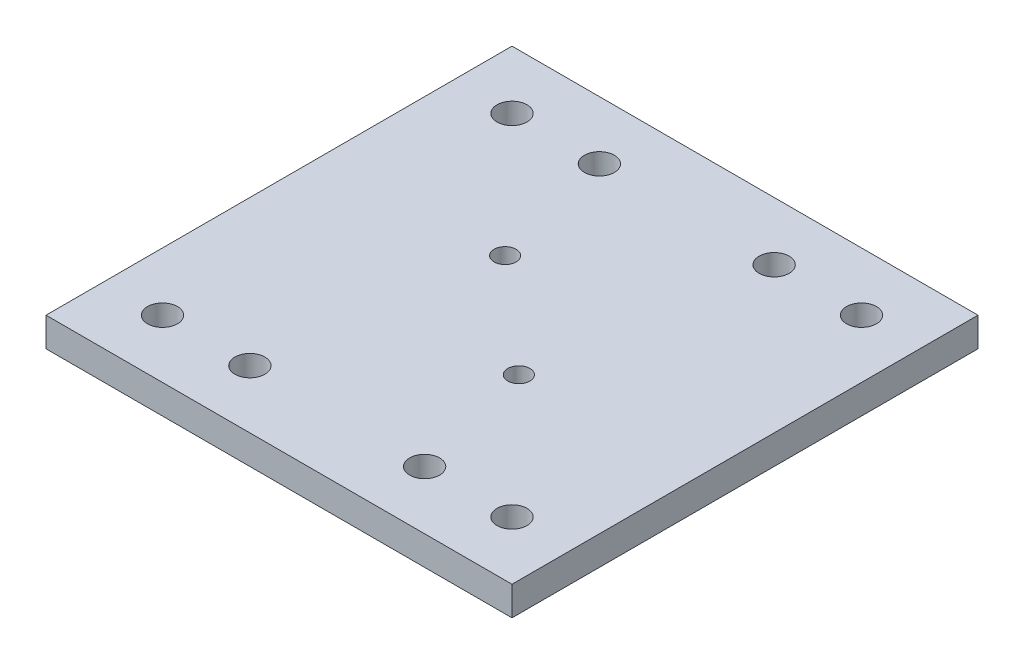
ISO-10303-21;
HEADER;
FILE_DESCRIPTION(('STEP AP214'),'2;1');
FILE_NAME('part.step','',(''),(''),'','','');
FILE_SCHEMA(('AUTOMOTIVE_DESIGN { 1 0 10303 214 1 1 1 1 }'));
ENDSEC;
DATA;
#1=APPLICATION_CONTEXT('core data for automotive mechanical design processes');
#2=APPLICATION_PROTOCOL_DEFINITION('international standard','automotive_design',2000,#1);
#3=PRODUCT_CONTEXT('',#1,'mechanical');
#4=PRODUCT('Part','Part','',(#3));
#5=PRODUCT_RELATED_PRODUCT_CATEGORY('part','',(#4));
#6=PRODUCT_DEFINITION_FORMATION('','',#4);
#7=PRODUCT_DEFINITION_CONTEXT('part definition',#1,'design');
#8=PRODUCT_DEFINITION('design','',#6,#7);
#9=PRODUCT_DEFINITION_SHAPE('','',#8);
#10=(LENGTH_UNIT() NAMED_UNIT(*) SI_UNIT(.MILLI.,.METRE.));
#11=(NAMED_UNIT(*) PLANE_ANGLE_UNIT() SI_UNIT($,.RADIAN.));
#12=(NAMED_UNIT(*) SI_UNIT($,.STERADIAN.) SOLID_ANGLE_UNIT());
#13=UNCERTAINTY_MEASURE_WITH_UNIT(LENGTH_MEASURE(1.E-05),#10,'distance_accuracy_value','');
#14=(GEOMETRIC_REPRESENTATION_CONTEXT(3) GLOBAL_UNCERTAINTY_ASSIGNED_CONTEXT((#13)) GLOBAL_UNIT_ASSIGNED_CONTEXT((#10,
#11,#12)) REPRESENTATION_CONTEXT('',''));
#15=CARTESIAN_POINT('',(0.,0.,0.));
#16=DIRECTION('',(0.,0.,1.));
#17=DIRECTION('',(1.,0.,0.));
#18=AXIS2_PLACEMENT_3D('',#15,#16,#17);
#19=CARTESIAN_POINT('',(25.4,3.175,-25.4));
#20=DIRECTION('',(-1.,0.,0.));
#21=DIRECTION('',(0.,0.,1.));
#22=AXIS2_PLACEMENT_3D('',#19,#20,#21);
#23=PLANE('',#22);
#24=DIRECTION('',(0.,0.,-1.));
#25=VECTOR('',#24,1.);
#26=CARTESIAN_POINT('',(25.4,0.,-25.4));
#27=LINE('',#26,#25);
#28=CARTESIAN_POINT('',(25.4,0.,25.4));
#29=VERTEX_POINT('',#28);
#30=CARTESIAN_POINT('',(25.4,0.,-25.4));
#31=VERTEX_POINT('',#30);
#32=EDGE_CURVE('E95',#29,#31,#27,.T.);
#33=ORIENTED_EDGE('',*,*,#32,.T.);
#34=DIRECTION('',(0.,-1.,0.));
#35=VECTOR('',#34,1.);
#36=CARTESIAN_POINT('',(25.4,3.175,-25.4));
#37=LINE('',#36,#35);
#38=CARTESIAN_POINT('',(25.4,3.175,-25.4));
#39=VERTEX_POINT('',#38);
#40=EDGE_CURVE('E11',#39,#31,#37,.T.);
#41=ORIENTED_EDGE('',*,*,#40,.F.);
#42=DIRECTION('',(0.,0.,-1.));
#43=VECTOR('',#42,1.);
#44=CARTESIAN_POINT('',(25.4,3.175,-25.4));
#45=LINE('',#44,#43);
#46=CARTESIAN_POINT('',(25.4,3.175,25.4));
#47=VERTEX_POINT('',#46);
#48=EDGE_CURVE('E83',#47,#39,#45,.T.);
#49=ORIENTED_EDGE('',*,*,#48,.F.);
#50=DIRECTION('',(0.,-1.,0.));
#51=VECTOR('',#50,1.);
#52=CARTESIAN_POINT('',(25.4,3.175,25.4));
#53=LINE('',#52,#51);
#54=EDGE_CURVE('E91',#47,#29,#53,.T.);
#55=ORIENTED_EDGE('',*,*,#54,.T.);
#56=EDGE_LOOP('',(#33,#41,#49,#55));
#57=FACE_BOUND('',#56,.T.);
#58=ADVANCED_FACE('F32',(#57),#23,.F.);
#59=CARTESIAN_POINT('',(-25.4,3.175,-25.4));
#60=DIRECTION('',(0.,0.,1.));
#61=DIRECTION('',(1.,0.,0.));
#62=AXIS2_PLACEMENT_3D('',#59,#60,#61);
#63=PLANE('',#62);
#64=DIRECTION('',(-1.,0.,0.));
#65=VECTOR('',#64,1.);
#66=CARTESIAN_POINT('',(-25.4,0.,-25.4));
#67=LINE('',#66,#65);
#68=CARTESIAN_POINT('',(-25.4,0.,-25.4));
#69=VERTEX_POINT('',#68);
#70=EDGE_CURVE('E87',#31,#69,#67,.T.);
#71=ORIENTED_EDGE('',*,*,#70,.T.);
#72=DIRECTION('',(0.,-1.,0.));
#73=VECTOR('',#72,1.);
#74=CARTESIAN_POINT('',(-25.4,3.175,-25.4));
#75=LINE('',#74,#73);
#76=CARTESIAN_POINT('',(-25.4,3.175,-25.4));
#77=VERTEX_POINT('',#76);
#78=EDGE_CURVE('E40',#77,#69,#75,.T.);
#79=ORIENTED_EDGE('',*,*,#78,.F.);
#80=DIRECTION('',(-1.,0.,0.));
#81=VECTOR('',#80,1.);
#82=CARTESIAN_POINT('',(-25.4,3.175,-25.4));
#83=LINE('',#82,#81);
#84=EDGE_CURVE('E78',#39,#77,#83,.T.);
#85=ORIENTED_EDGE('',*,*,#84,.F.);
#86=ORIENTED_EDGE('',*,*,#40,.T.);
#87=EDGE_LOOP('',(#71,#79,#85,#86));
#88=FACE_BOUND('',#87,.T.);
#89=ADVANCED_FACE('F86',(#88),#63,.F.);
#90=CARTESIAN_POINT('',(-25.4,3.175,-25.4));
#91=DIRECTION('',(1.,0.,0.));
#92=DIRECTION('',(0.,0.,-1.));
#93=AXIS2_PLACEMENT_3D('',#90,#91,#92);
#94=PLANE('',#93);
#95=DIRECTION('',(0.,0.,1.));
#96=VECTOR('',#95,1.);
#97=CARTESIAN_POINT('',(-25.4,0.,-25.4));
#98=LINE('',#97,#96);
#99=CARTESIAN_POINT('',(-25.4,0.,25.4));
#100=VERTEX_POINT('',#99);
#101=EDGE_CURVE('E65',#69,#100,#98,.T.);
#102=ORIENTED_EDGE('',*,*,#101,.T.);
#103=DIRECTION('',(0.,-1.,0.));
#104=VECTOR('',#103,1.);
#105=CARTESIAN_POINT('',(-25.4,3.175,25.4));
#106=LINE('',#105,#104);
#107=CARTESIAN_POINT('',(-25.4,3.175,25.4));
#108=VERTEX_POINT('',#107);
#109=EDGE_CURVE('E88',#108,#100,#106,.T.);
#110=ORIENTED_EDGE('',*,*,#109,.F.);
#111=DIRECTION('',(0.,0.,1.));
#112=VECTOR('',#111,1.);
#113=CARTESIAN_POINT('',(-25.4,3.175,-25.4));
#114=LINE('',#113,#112);
#115=EDGE_CURVE('E81',#77,#108,#114,.T.);
#116=ORIENTED_EDGE('',*,*,#115,.F.);
#117=ORIENTED_EDGE('',*,*,#78,.T.);
#118=EDGE_LOOP('',(#102,#110,#116,#117));
#119=FACE_BOUND('',#118,.T.);
#120=ADVANCED_FACE('F89',(#119),#94,.F.);
#121=CARTESIAN_POINT('',(-25.4,3.175,25.4));
#122=DIRECTION('',(0.,0.,-1.));
#123=DIRECTION('',(-1.,0.,0.));
#124=AXIS2_PLACEMENT_3D('',#121,#122,#123);
#125=PLANE('',#124);
#126=DIRECTION('',(1.,0.,0.));
#127=VECTOR('',#126,1.);
#128=CARTESIAN_POINT('',(-25.4,0.,25.4));
#129=LINE('',#128,#127);
#130=EDGE_CURVE('E71',#100,#29,#129,.T.);
#131=ORIENTED_EDGE('',*,*,#130,.T.);
#132=ORIENTED_EDGE('',*,*,#54,.F.);
#133=DIRECTION('',(1.,0.,0.));
#134=VECTOR('',#133,1.);
#135=CARTESIAN_POINT('',(-25.4,3.175,25.4));
#136=LINE('',#135,#134);
#137=EDGE_CURVE('E48',#108,#47,#136,.T.);
#138=ORIENTED_EDGE('',*,*,#137,.F.);
#139=ORIENTED_EDGE('',*,*,#109,.T.);
#140=EDGE_LOOP('',(#131,#132,#138,#139));
#141=FACE_BOUND('',#140,.T.);
#142=ADVANCED_FACE('F103',(#141),#125,.F.);
#143=CARTESIAN_POINT('',(0.,3.175,0.));
#144=DIRECTION('',(0.,1.,0.));
#145=DIRECTION('',(0.,0.,1.));
#146=AXIS2_PLACEMENT_3D('',#143,#144,#145);
#147=PLANE('',#146);
#148=CARTESIAN_POINT('',(-9.52500000000002,3.175,-19.05));
#149=DIRECTION('',(0.,1.,0.));
#150=DIRECTION('',(0.,0.,1.));
#151=AXIS2_PLACEMENT_3D('',#148,#149,#150);
#152=CIRCLE('',#151,1.63194999999999);
#153=CARTESIAN_POINT('',(-9.52500000000002,3.175,-17.41805));
#154=VERTEX_POINT('',#153);
#155=EDGE_CURVE('E165',#154,#154,#152,.T.);
#156=ORIENTED_EDGE('',*,*,#155,.F.);
#157=EDGE_LOOP('',(#156));
#158=FACE_BOUND('',#157,.T.);
#159=CARTESIAN_POINT('',(9.52499999999998,3.175,-19.05));
#160=DIRECTION('',(0.,1.,0.));
#161=DIRECTION('',(0.,0.,1.));
#162=AXIS2_PLACEMENT_3D('',#159,#160,#161);
#163=CIRCLE('',#162,1.63194999999999);
#164=CARTESIAN_POINT('',(9.52499999999998,3.175,-17.41805));
#165=VERTEX_POINT('',#164);
#166=EDGE_CURVE('E159',#165,#165,#163,.T.);
#167=ORIENTED_EDGE('',*,*,#166,.F.);
#168=EDGE_LOOP('',(#167));
#169=FACE_BOUND('',#168,.T.);
#170=CARTESIAN_POINT('',(9.52499999999999,3.175,19.05));
#171=DIRECTION('',(0.,1.,0.));
#172=DIRECTION('',(0.,0.,1.));
#173=AXIS2_PLACEMENT_3D('',#170,#171,#172);
#174=CIRCLE('',#173,1.63194999999999);
#175=CARTESIAN_POINT('',(9.52499999999999,3.175,20.68195));
#176=VERTEX_POINT('',#175);
#177=EDGE_CURVE('E153',#176,#176,#174,.T.);
#178=ORIENTED_EDGE('',*,*,#177,.F.);
#179=EDGE_LOOP('',(#178));
#180=FACE_BOUND('',#179,.T.);
#181=CARTESIAN_POINT('',(-9.52500000000001,3.175,19.05));
#182=DIRECTION('',(0.,1.,0.));
#183=DIRECTION('',(0.,0.,1.));
#184=AXIS2_PLACEMENT_3D('',#181,#182,#183);
#185=CIRCLE('',#184,1.63194999999999);
#186=CARTESIAN_POINT('',(-9.52500000000001,3.175,20.68195));
#187=VERTEX_POINT('',#186);
#188=EDGE_CURVE('E147',#187,#187,#185,.T.);
#189=ORIENTED_EDGE('',*,*,#188,.F.);
#190=EDGE_LOOP('',(#189));
#191=FACE_BOUND('',#190,.T.);
#192=CARTESIAN_POINT('',(-19.05,3.175,19.05));
#193=DIRECTION('',(0.,1.,0.));
#194=DIRECTION('',(0.,0.,1.));
#195=AXIS2_PLACEMENT_3D('',#192,#193,#194);
#196=CIRCLE('',#195,1.63195);
#197=CARTESIAN_POINT('',(-19.05,3.175,20.68195));
#198=VERTEX_POINT('',#197);
#199=EDGE_CURVE('E141',#198,#198,#196,.T.);
#200=ORIENTED_EDGE('',*,*,#199,.F.);
#201=EDGE_LOOP('',(#200));
#202=FACE_BOUND('',#201,.T.);
#203=CARTESIAN_POINT('',(19.05,3.175,-19.05));
#204=DIRECTION('',(0.,1.,0.));
#205=DIRECTION('',(0.,0.,1.));
#206=AXIS2_PLACEMENT_3D('',#203,#204,#205);
#207=CIRCLE('',#206,1.63195);
#208=CARTESIAN_POINT('',(19.05,3.175,-17.41805));
#209=VERTEX_POINT('',#208);
#210=EDGE_CURVE('E135',#209,#209,#207,.T.);
#211=ORIENTED_EDGE('',*,*,#210,.F.);
#212=EDGE_LOOP('',(#211));
#213=FACE_BOUND('',#212,.T.);
#214=CARTESIAN_POINT('',(19.05,3.175,19.05));
#215=DIRECTION('',(0.,1.,0.));
#216=DIRECTION('',(0.,0.,1.));
#217=AXIS2_PLACEMENT_3D('',#214,#215,#216);
#218=CIRCLE('',#217,1.63195);
#219=CARTESIAN_POINT('',(19.05,3.175,20.68195));
#220=VERTEX_POINT('',#219);
#221=EDGE_CURVE('E129',#220,#220,#218,.T.);
#222=ORIENTED_EDGE('',*,*,#221,.F.);
#223=EDGE_LOOP('',(#222));
#224=FACE_BOUND('',#223,.T.);
#225=CARTESIAN_POINT('',(-19.05,3.175,-19.05));
#226=DIRECTION('',(0.,1.,0.));
#227=DIRECTION('',(0.,0.,1.));
#228=AXIS2_PLACEMENT_3D('',#225,#226,#227);
#229=CIRCLE('',#228,1.63195);
#230=CARTESIAN_POINT('',(-19.05,3.175,-17.41805));
#231=VERTEX_POINT('',#230);
#232=EDGE_CURVE('E123',#231,#231,#229,.T.);
#233=ORIENTED_EDGE('',*,*,#232,.F.);
#234=EDGE_LOOP('',(#233));
#235=FACE_BOUND('',#234,.T.);
#236=CARTESIAN_POINT('',(6.,3.175,5.25));
#237=DIRECTION('',(0.,1.,0.));
#238=DIRECTION('',(0.,0.,1.));
#239=AXIS2_PLACEMENT_3D('',#236,#237,#238);
#240=CIRCLE('',#239,1.2);
#241=CARTESIAN_POINT('',(6.,3.175,6.45));
#242=VERTEX_POINT('',#241);
#243=EDGE_CURVE('E117',#242,#242,#240,.T.);
#244=ORIENTED_EDGE('',*,*,#243,.F.);
#245=EDGE_LOOP('',(#244));
#246=FACE_BOUND('',#245,.T.);
#247=CARTESIAN_POINT('',(-6.,3.175,-5.25));
#248=DIRECTION('',(0.,1.,0.));
#249=DIRECTION('',(0.,0.,1.));
#250=AXIS2_PLACEMENT_3D('',#247,#248,#249);
#251=CIRCLE('',#250,1.2);
#252=CARTESIAN_POINT('',(-6.,3.175,-4.05));
#253=VERTEX_POINT('',#252);
#254=EDGE_CURVE('E111',#253,#253,#251,.T.);
#255=ORIENTED_EDGE('',*,*,#254,.F.);
#256=EDGE_LOOP('',(#255));
#257=FACE_BOUND('',#256,.T.);
#258=ORIENTED_EDGE('',*,*,#48,.T.);
#259=ORIENTED_EDGE('',*,*,#84,.T.);
#260=ORIENTED_EDGE('',*,*,#115,.T.);
#261=ORIENTED_EDGE('',*,*,#137,.T.);
#262=EDGE_LOOP('',(#258,#259,#260,#261));
#263=FACE_BOUND('',#262,.T.);
#264=ADVANCED_FACE('F79',(#158,#169,#180,#191,#202,#213,#224,#235,#246,#257,#263),#147,.T.);
#265=CARTESIAN_POINT('',(0.,0.,0.));
#266=DIRECTION('',(0.,1.,0.));
#267=DIRECTION('',(0.,0.,1.));
#268=AXIS2_PLACEMENT_3D('',#265,#266,#267);
#269=PLANE('',#268);
#270=CARTESIAN_POINT('',(-9.52500000000002,0.,-19.05));
#271=DIRECTION('',(0.,1.,0.));
#272=DIRECTION('',(0.,0.,1.));
#273=AXIS2_PLACEMENT_3D('',#270,#271,#272);
#274=CIRCLE('',#273,1.63194999999999);
#275=CARTESIAN_POINT('',(-9.52500000000002,0.,-17.41805));
#276=VERTEX_POINT('',#275);
#277=EDGE_CURVE('E162',#276,#276,#274,.T.);
#278=ORIENTED_EDGE('',*,*,#277,.T.);
#279=EDGE_LOOP('',(#278));
#280=FACE_BOUND('',#279,.T.);
#281=CARTESIAN_POINT('',(9.52499999999998,0.,-19.05));
#282=DIRECTION('',(0.,1.,0.));
#283=DIRECTION('',(0.,0.,1.));
#284=AXIS2_PLACEMENT_3D('',#281,#282,#283);
#285=CIRCLE('',#284,1.63194999999999);
#286=CARTESIAN_POINT('',(9.52499999999998,0.,-17.41805));
#287=VERTEX_POINT('',#286);
#288=EDGE_CURVE('E156',#287,#287,#285,.T.);
#289=ORIENTED_EDGE('',*,*,#288,.T.);
#290=EDGE_LOOP('',(#289));
#291=FACE_BOUND('',#290,.T.);
#292=CARTESIAN_POINT('',(9.52499999999999,0.,19.05));
#293=DIRECTION('',(0.,1.,0.));
#294=DIRECTION('',(0.,0.,1.));
#295=AXIS2_PLACEMENT_3D('',#292,#293,#294);
#296=CIRCLE('',#295,1.63194999999999);
#297=CARTESIAN_POINT('',(9.52499999999999,0.,20.68195));
#298=VERTEX_POINT('',#297);
#299=EDGE_CURVE('E150',#298,#298,#296,.T.);
#300=ORIENTED_EDGE('',*,*,#299,.T.);
#301=EDGE_LOOP('',(#300));
#302=FACE_BOUND('',#301,.T.);
#303=CARTESIAN_POINT('',(-9.52500000000001,0.,19.05));
#304=DIRECTION('',(0.,1.,0.));
#305=DIRECTION('',(0.,0.,1.));
#306=AXIS2_PLACEMENT_3D('',#303,#304,#305);
#307=CIRCLE('',#306,1.63194999999999);
#308=CARTESIAN_POINT('',(-9.52500000000001,0.,20.68195));
#309=VERTEX_POINT('',#308);
#310=EDGE_CURVE('E144',#309,#309,#307,.T.);
#311=ORIENTED_EDGE('',*,*,#310,.T.);
#312=EDGE_LOOP('',(#311));
#313=FACE_BOUND('',#312,.T.);
#314=CARTESIAN_POINT('',(-19.05,0.,19.05));
#315=DIRECTION('',(0.,1.,0.));
#316=DIRECTION('',(0.,0.,1.));
#317=AXIS2_PLACEMENT_3D('',#314,#315,#316);
#318=CIRCLE('',#317,1.63195);
#319=CARTESIAN_POINT('',(-19.05,0.,20.68195));
#320=VERTEX_POINT('',#319);
#321=EDGE_CURVE('E138',#320,#320,#318,.T.);
#322=ORIENTED_EDGE('',*,*,#321,.T.);
#323=EDGE_LOOP('',(#322));
#324=FACE_BOUND('',#323,.T.);
#325=CARTESIAN_POINT('',(19.05,0.,-19.05));
#326=DIRECTION('',(0.,1.,0.));
#327=DIRECTION('',(0.,0.,1.));
#328=AXIS2_PLACEMENT_3D('',#325,#326,#327);
#329=CIRCLE('',#328,1.63195);
#330=CARTESIAN_POINT('',(19.05,0.,-17.41805));
#331=VERTEX_POINT('',#330);
#332=EDGE_CURVE('E132',#331,#331,#329,.T.);
#333=ORIENTED_EDGE('',*,*,#332,.T.);
#334=EDGE_LOOP('',(#333));
#335=FACE_BOUND('',#334,.T.);
#336=CARTESIAN_POINT('',(19.05,0.,19.05));
#337=DIRECTION('',(0.,1.,0.));
#338=DIRECTION('',(0.,0.,1.));
#339=AXIS2_PLACEMENT_3D('',#336,#337,#338);
#340=CIRCLE('',#339,1.63195);
#341=CARTESIAN_POINT('',(19.05,0.,20.68195));
#342=VERTEX_POINT('',#341);
#343=EDGE_CURVE('E126',#342,#342,#340,.T.);
#344=ORIENTED_EDGE('',*,*,#343,.T.);
#345=EDGE_LOOP('',(#344));
#346=FACE_BOUND('',#345,.T.);
#347=CARTESIAN_POINT('',(-19.05,0.,-19.05));
#348=DIRECTION('',(0.,1.,0.));
#349=DIRECTION('',(0.,0.,1.));
#350=AXIS2_PLACEMENT_3D('',#347,#348,#349);
#351=CIRCLE('',#350,1.63195);
#352=CARTESIAN_POINT('',(-19.05,0.,-17.41805));
#353=VERTEX_POINT('',#352);
#354=EDGE_CURVE('E120',#353,#353,#351,.T.);
#355=ORIENTED_EDGE('',*,*,#354,.T.);
#356=EDGE_LOOP('',(#355));
#357=FACE_BOUND('',#356,.T.);
#358=CARTESIAN_POINT('',(6.,0.,5.25));
#359=DIRECTION('',(0.,1.,0.));
#360=DIRECTION('',(0.,0.,1.));
#361=AXIS2_PLACEMENT_3D('',#358,#359,#360);
#362=CIRCLE('',#361,1.2);
#363=CARTESIAN_POINT('',(6.,0.,6.45));
#364=VERTEX_POINT('',#363);
#365=EDGE_CURVE('E114',#364,#364,#362,.T.);
#366=ORIENTED_EDGE('',*,*,#365,.T.);
#367=EDGE_LOOP('',(#366));
#368=FACE_BOUND('',#367,.T.);
#369=CARTESIAN_POINT('',(-6.,0.,-5.25));
#370=DIRECTION('',(0.,1.,0.));
#371=DIRECTION('',(0.,0.,1.));
#372=AXIS2_PLACEMENT_3D('',#369,#370,#371);
#373=CIRCLE('',#372,1.2);
#374=CARTESIAN_POINT('',(-6.,0.,-4.05));
#375=VERTEX_POINT('',#374);
#376=EDGE_CURVE('E98',#375,#375,#373,.T.);
#377=ORIENTED_EDGE('',*,*,#376,.T.);
#378=EDGE_LOOP('',(#377));
#379=FACE_BOUND('',#378,.T.);
#380=ORIENTED_EDGE('',*,*,#32,.F.);
#381=ORIENTED_EDGE('',*,*,#130,.F.);
#382=ORIENTED_EDGE('',*,*,#101,.F.);
#383=ORIENTED_EDGE('',*,*,#70,.F.);
#384=EDGE_LOOP('',(#380,#381,#382,#383));
#385=FACE_BOUND('',#384,.T.);
#386=ADVANCED_FACE('F106',(#280,#291,#302,#313,#324,#335,#346,#357,#368,#379,#385),#269,.F.);
#387=CARTESIAN_POINT('',(-6.,3.175,-5.25));
#388=DIRECTION('',(0.,1.,0.));
#389=DIRECTION('',(0.,0.,1.));
#390=AXIS2_PLACEMENT_3D('',#387,#388,#389);
#391=CYLINDRICAL_SURFACE('',#390,1.2);
#392=ORIENTED_EDGE('',*,*,#376,.F.);
#393=EDGE_LOOP('',(#392));
#394=FACE_BOUND('',#393,.T.);
#395=ORIENTED_EDGE('',*,*,#254,.T.);
#396=EDGE_LOOP('',(#395));
#397=FACE_BOUND('',#396,.T.);
#398=ADVANCED_FACE('F192',(#394,#397),#391,.F.);
#399=CARTESIAN_POINT('',(6.,3.175,5.25));
#400=DIRECTION('',(0.,1.,0.));
#401=DIRECTION('',(0.,0.,1.));
#402=AXIS2_PLACEMENT_3D('',#399,#400,#401);
#403=CYLINDRICAL_SURFACE('',#402,1.2);
#404=ORIENTED_EDGE('',*,*,#365,.F.);
#405=EDGE_LOOP('',(#404));
#406=FACE_BOUND('',#405,.T.);
#407=ORIENTED_EDGE('',*,*,#243,.T.);
#408=EDGE_LOOP('',(#407));
#409=FACE_BOUND('',#408,.T.);
#410=ADVANCED_FACE('F194',(#406,#409),#403,.F.);
#411=CARTESIAN_POINT('',(-19.05,3.175,-19.05));
#412=DIRECTION('',(0.,1.,0.));
#413=DIRECTION('',(0.,0.,1.));
#414=AXIS2_PLACEMENT_3D('',#411,#412,#413);
#415=CYLINDRICAL_SURFACE('',#414,1.63195);
#416=ORIENTED_EDGE('',*,*,#354,.F.);
#417=EDGE_LOOP('',(#416));
#418=FACE_BOUND('',#417,.T.);
#419=ORIENTED_EDGE('',*,*,#232,.T.);
#420=EDGE_LOOP('',(#419));
#421=FACE_BOUND('',#420,.T.);
#422=ADVANCED_FACE('F201',(#418,#421),#415,.F.);
#423=CARTESIAN_POINT('',(19.05,3.175,19.05));
#424=DIRECTION('',(0.,1.,0.));
#425=DIRECTION('',(0.,0.,1.));
#426=AXIS2_PLACEMENT_3D('',#423,#424,#425);
#427=CYLINDRICAL_SURFACE('',#426,1.63195);
#428=ORIENTED_EDGE('',*,*,#343,.F.);
#429=EDGE_LOOP('',(#428));
#430=FACE_BOUND('',#429,.T.);
#431=ORIENTED_EDGE('',*,*,#221,.T.);
#432=EDGE_LOOP('',(#431));
#433=FACE_BOUND('',#432,.T.);
#434=ADVANCED_FACE('F286',(#430,#433),#427,.F.);
#435=CARTESIAN_POINT('',(19.05,3.175,-19.05));
#436=DIRECTION('',(0.,1.,0.));
#437=DIRECTION('',(0.,0.,1.));
#438=AXIS2_PLACEMENT_3D('',#435,#436,#437);
#439=CYLINDRICAL_SURFACE('',#438,1.63195);
#440=ORIENTED_EDGE('',*,*,#332,.F.);
#441=EDGE_LOOP('',(#440));
#442=FACE_BOUND('',#441,.T.);
#443=ORIENTED_EDGE('',*,*,#210,.T.);
#444=EDGE_LOOP('',(#443));
#445=FACE_BOUND('',#444,.T.);
#446=ADVANCED_FACE('F282',(#442,#445),#439,.F.);
#447=CARTESIAN_POINT('',(-19.05,3.175,19.05));
#448=DIRECTION('',(0.,1.,0.));
#449=DIRECTION('',(0.,0.,1.));
#450=AXIS2_PLACEMENT_3D('',#447,#448,#449);
#451=CYLINDRICAL_SURFACE('',#450,1.63195);
#452=ORIENTED_EDGE('',*,*,#321,.F.);
#453=EDGE_LOOP('',(#452));
#454=FACE_BOUND('',#453,.T.);
#455=ORIENTED_EDGE('',*,*,#199,.T.);
#456=EDGE_LOOP('',(#455));
#457=FACE_BOUND('',#456,.T.);
#458=ADVANCED_FACE('F244',(#454,#457),#451,.F.);
#459=CARTESIAN_POINT('',(-9.52500000000001,3.175,19.05));
#460=DIRECTION('',(0.,1.,0.));
#461=DIRECTION('',(0.,0.,1.));
#462=AXIS2_PLACEMENT_3D('',#459,#460,#461);
#463=CYLINDRICAL_SURFACE('',#462,1.63194999999999);
#464=ORIENTED_EDGE('',*,*,#310,.F.);
#465=EDGE_LOOP('',(#464));
#466=FACE_BOUND('',#465,.T.);
#467=ORIENTED_EDGE('',*,*,#188,.T.);
#468=EDGE_LOOP('',(#467));
#469=FACE_BOUND('',#468,.T.);
#470=ADVANCED_FACE('F238',(#466,#469),#463,.F.);
#471=CARTESIAN_POINT('',(9.52499999999999,3.175,19.05));
#472=DIRECTION('',(0.,1.,0.));
#473=DIRECTION('',(0.,0.,1.));
#474=AXIS2_PLACEMENT_3D('',#471,#472,#473);
#475=CYLINDRICAL_SURFACE('',#474,1.63194999999999);
#476=ORIENTED_EDGE('',*,*,#299,.F.);
#477=EDGE_LOOP('',(#476));
#478=FACE_BOUND('',#477,.T.);
#479=ORIENTED_EDGE('',*,*,#177,.T.);
#480=EDGE_LOOP('',(#479));
#481=FACE_BOUND('',#480,.T.);
#482=ADVANCED_FACE('F243',(#478,#481),#475,.F.);
#483=CARTESIAN_POINT('',(9.52499999999998,3.175,-19.05));
#484=DIRECTION('',(0.,1.,0.));
#485=DIRECTION('',(0.,0.,1.));
#486=AXIS2_PLACEMENT_3D('',#483,#484,#485);
#487=CYLINDRICAL_SURFACE('',#486,1.63194999999999);
#488=ORIENTED_EDGE('',*,*,#288,.F.);
#489=EDGE_LOOP('',(#488));
#490=FACE_BOUND('',#489,.T.);
#491=ORIENTED_EDGE('',*,*,#166,.T.);
#492=EDGE_LOOP('',(#491));
#493=FACE_BOUND('',#492,.T.);
#494=ADVANCED_FACE('F256',(#490,#493),#487,.F.);
#495=CARTESIAN_POINT('',(-9.52500000000002,3.175,-19.05));
#496=DIRECTION('',(0.,1.,0.));
#497=DIRECTION('',(0.,0.,1.));
#498=AXIS2_PLACEMENT_3D('',#495,#496,#497);
#499=CYLINDRICAL_SURFACE('',#498,1.63194999999999);
#500=ORIENTED_EDGE('',*,*,#277,.F.);
#501=EDGE_LOOP('',(#500));
#502=FACE_BOUND('',#501,.T.);
#503=ORIENTED_EDGE('',*,*,#155,.T.);
#504=EDGE_LOOP('',(#503));
#505=FACE_BOUND('',#504,.T.);
#506=ADVANCED_FACE('F169',(#502,#505),#499,.F.);
#507=CLOSED_SHELL('',(#58,#89,#120,#142,#264,#386,#398,#410,#422,#434,#446,#458,#470,#482,#494,#506));
#508=MANIFOLD_SOLID_BREP('B2',#507);
#509=ADVANCED_BREP_SHAPE_REPRESENTATION('',(#18,#508),#14);
#510=SHAPE_DEFINITION_REPRESENTATION(#9,#509);
ENDSEC;
END-ISO-10303-21;
